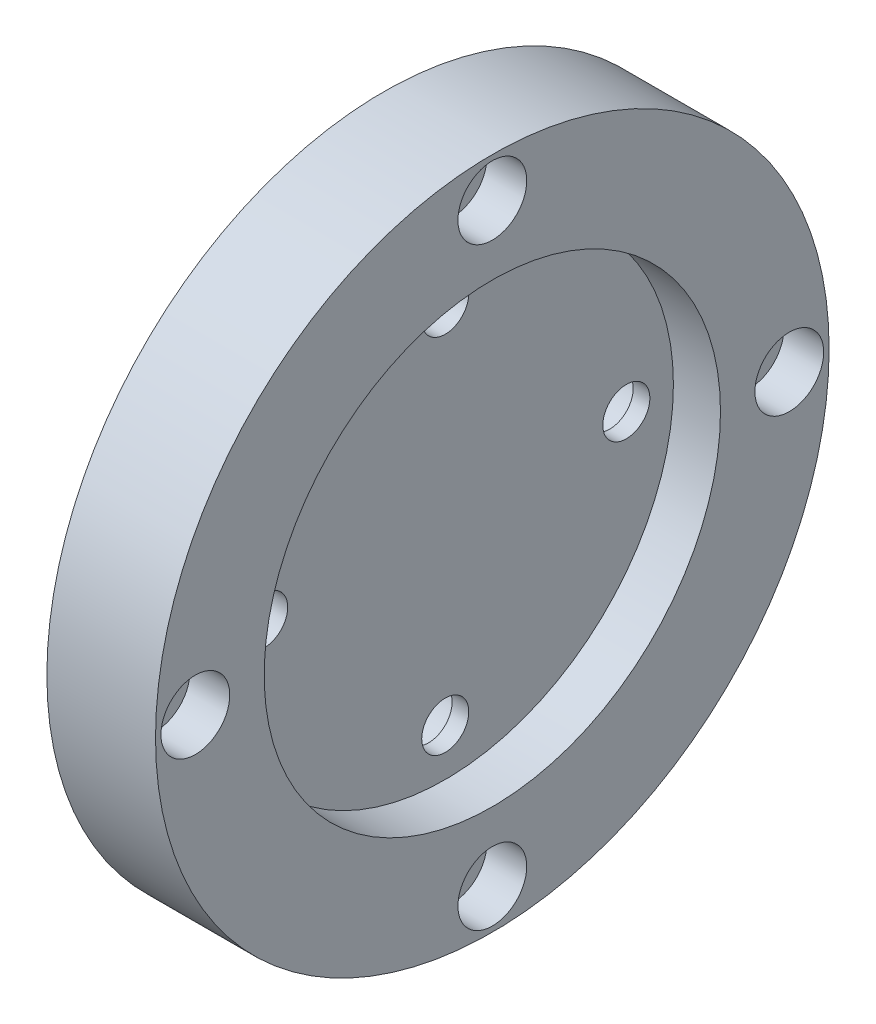
ISO-10303-21;
HEADER;
FILE_DESCRIPTION(('STEP AP214'),'2;1');
FILE_NAME('part.step','',(''),(''),'','','');
FILE_SCHEMA(('AUTOMOTIVE_DESIGN { 1 0 10303 214 1 1 1 1 }'));
ENDSEC;
DATA;
#1=APPLICATION_CONTEXT('core data for automotive mechanical design processes');
#2=APPLICATION_PROTOCOL_DEFINITION('international standard','automotive_design',2000,#1);
#3=PRODUCT_CONTEXT('',#1,'mechanical');
#4=PRODUCT('Part','Part','',(#3));
#5=PRODUCT_RELATED_PRODUCT_CATEGORY('part','',(#4));
#6=PRODUCT_DEFINITION_FORMATION('','',#4);
#7=PRODUCT_DEFINITION_CONTEXT('part definition',#1,'design');
#8=PRODUCT_DEFINITION('design','',#6,#7);
#9=PRODUCT_DEFINITION_SHAPE('','',#8);
#10=(LENGTH_UNIT() NAMED_UNIT(*) SI_UNIT(.MILLI.,.METRE.));
#11=(NAMED_UNIT(*) PLANE_ANGLE_UNIT() SI_UNIT($,.RADIAN.));
#12=(NAMED_UNIT(*) SI_UNIT($,.STERADIAN.) SOLID_ANGLE_UNIT());
#13=UNCERTAINTY_MEASURE_WITH_UNIT(LENGTH_MEASURE(1.E-05),#10,'distance_accuracy_value','');
#14=(GEOMETRIC_REPRESENTATION_CONTEXT(3) GLOBAL_UNCERTAINTY_ASSIGNED_CONTEXT((#13)) GLOBAL_UNIT_ASSIGNED_CONTEXT((#10,
#11,#12)) REPRESENTATION_CONTEXT('',''));
#15=CARTESIAN_POINT('',(0.,0.,0.));
#16=DIRECTION('',(0.,0.,1.));
#17=DIRECTION('',(1.,0.,0.));
#18=AXIS2_PLACEMENT_3D('',#15,#16,#17);
#19=CARTESIAN_POINT('',(0.,0.,-41.));
#20=DIRECTION('',(1.,0.,0.));
#21=DIRECTION('',(0.,0.,-1.));
#22=AXIS2_PLACEMENT_3D('',#19,#20,#21);
#23=CYLINDRICAL_SURFACE('',#22,2.75);
#24=CARTESIAN_POINT('',(0.,0.,-41.));
#25=DIRECTION('',(1.,0.,0.));
#26=DIRECTION('',(0.,0.,-1.));
#27=AXIS2_PLACEMENT_3D('',#24,#25,#26);
#28=CIRCLE('',#27,2.75);
#29=CARTESIAN_POINT('',(0.,0.,-43.75));
#30=VERTEX_POINT('',#29);
#31=EDGE_CURVE('E119',#30,#30,#28,.T.);
#32=ORIENTED_EDGE('',*,*,#31,.F.);
#33=EDGE_LOOP('',(#32));
#34=FACE_BOUND('',#33,.T.);
#35=CARTESIAN_POINT('',(9.5,0.,-41.));
#36=DIRECTION('',(1.,0.,0.));
#37=DIRECTION('',(0.,0.,-1.));
#38=AXIS2_PLACEMENT_3D('',#35,#36,#37);
#39=CIRCLE('',#38,2.75);
#40=CARTESIAN_POINT('',(9.5,0.,-43.75));
#41=VERTEX_POINT('',#40);
#42=EDGE_CURVE('E46',#41,#41,#39,.F.);
#43=ORIENTED_EDGE('',*,*,#42,.F.);
#44=EDGE_LOOP('',(#43));
#45=FACE_BOUND('',#44,.T.);
#46=ADVANCED_FACE('F42',(#34,#45),#23,.F.);
#47=CARTESIAN_POINT('',(0.,0.,41.));
#48=DIRECTION('',(1.,0.,0.));
#49=DIRECTION('',(0.,0.,-1.));
#50=AXIS2_PLACEMENT_3D('',#47,#48,#49);
#51=CYLINDRICAL_SURFACE('',#50,2.75);
#52=CARTESIAN_POINT('',(0.,0.,41.));
#53=DIRECTION('',(1.,0.,0.));
#54=DIRECTION('',(0.,0.,1.));
#55=AXIS2_PLACEMENT_3D('',#52,#53,#54);
#56=CIRCLE('',#55,2.75);
#57=CARTESIAN_POINT('',(0.,0.,43.75));
#58=VERTEX_POINT('',#57);
#59=EDGE_CURVE('E120',#58,#58,#56,.T.);
#60=ORIENTED_EDGE('',*,*,#59,.F.);
#61=EDGE_LOOP('',(#60));
#62=FACE_BOUND('',#61,.T.);
#63=CARTESIAN_POINT('',(9.5,0.,41.));
#64=DIRECTION('',(1.,0.,0.));
#65=DIRECTION('',(0.,0.,-1.));
#66=AXIS2_PLACEMENT_3D('',#63,#64,#65);
#67=CIRCLE('',#66,2.75);
#68=CARTESIAN_POINT('',(9.5,0.,38.25));
#69=VERTEX_POINT('',#68);
#70=EDGE_CURVE('E91',#69,#69,#67,.F.);
#71=ORIENTED_EDGE('',*,*,#70,.F.);
#72=EDGE_LOOP('',(#71));
#73=FACE_BOUND('',#72,.T.);
#74=ADVANCED_FACE('F203',(#62,#73),#51,.F.);
#75=CARTESIAN_POINT('',(0.,41.,1.43150734892568E-13));
#76=DIRECTION('',(1.,0.,0.));
#77=DIRECTION('',(0.,0.,-1.));
#78=AXIS2_PLACEMENT_3D('',#75,#76,#77);
#79=CYLINDRICAL_SURFACE('',#78,2.75);
#80=CARTESIAN_POINT('',(0.,41.,1.43150734892568E-13));
#81=DIRECTION('',(1.,0.,0.));
#82=DIRECTION('',(0.,1.,0.));
#83=AXIS2_PLACEMENT_3D('',#80,#81,#82);
#84=CIRCLE('',#83,2.75);
#85=CARTESIAN_POINT('',(0.,43.75,1.52752308574387E-13));
#86=VERTEX_POINT('',#85);
#87=EDGE_CURVE('E115',#86,#86,#84,.T.);
#88=ORIENTED_EDGE('',*,*,#87,.F.);
#89=EDGE_LOOP('',(#88));
#90=FACE_BOUND('',#89,.T.);
#91=CARTESIAN_POINT('',(9.5,41.,1.43150734892568E-13));
#92=DIRECTION('',(1.,0.,0.));
#93=DIRECTION('',(0.,0.,-1.));
#94=AXIS2_PLACEMENT_3D('',#91,#92,#93);
#95=CIRCLE('',#94,2.75);
#96=CARTESIAN_POINT('',(9.5,41.,-2.74999999999986));
#97=VERTEX_POINT('',#96);
#98=EDGE_CURVE('E88',#97,#97,#95,.F.);
#99=ORIENTED_EDGE('',*,*,#98,.F.);
#100=EDGE_LOOP('',(#99));
#101=FACE_BOUND('',#100,.T.);
#102=ADVANCED_FACE('F209',(#90,#101),#79,.F.);
#103=CARTESIAN_POINT('',(0.,-41.,-4.29452204677705E-13));
#104=DIRECTION('',(1.,0.,0.));
#105=DIRECTION('',(0.,0.,-1.));
#106=AXIS2_PLACEMENT_3D('',#103,#104,#105);
#107=CYLINDRICAL_SURFACE('',#106,2.75);
#108=CARTESIAN_POINT('',(0.,-41.,-4.29452204677705E-13));
#109=DIRECTION('',(1.,0.,0.));
#110=DIRECTION('',(0.,-1.,0.));
#111=AXIS2_PLACEMENT_3D('',#108,#109,#110);
#112=CIRCLE('',#111,2.75);
#113=CARTESIAN_POINT('',(0.,-43.75,-4.58256925723161E-13));
#114=VERTEX_POINT('',#113);
#115=EDGE_CURVE('E86',#114,#114,#112,.T.);
#116=ORIENTED_EDGE('',*,*,#115,.F.);
#117=EDGE_LOOP('',(#116));
#118=FACE_BOUND('',#117,.T.);
#119=CARTESIAN_POINT('',(9.5,-41.,-4.29452204677705E-13));
#120=DIRECTION('',(1.,0.,0.));
#121=DIRECTION('',(0.,0.,-1.));
#122=AXIS2_PLACEMENT_3D('',#119,#120,#121);
#123=CIRCLE('',#122,2.75);
#124=CARTESIAN_POINT('',(9.5,-41.,-2.75000000000043));
#125=VERTEX_POINT('',#124);
#126=EDGE_CURVE('E82',#125,#125,#123,.F.);
#127=ORIENTED_EDGE('',*,*,#126,.F.);
#128=EDGE_LOOP('',(#127));
#129=FACE_BOUND('',#128,.T.);
#130=ADVANCED_FACE('F216',(#118,#129),#107,.F.);
#131=CARTESIAN_POINT('',(0.,25.,0.));
#132=DIRECTION('',(1.,0.,0.));
#133=DIRECTION('',(0.,0.,-1.));
#134=AXIS2_PLACEMENT_3D('',#131,#132,#133);
#135=CYLINDRICAL_SURFACE('',#134,3.25);
#136=CARTESIAN_POINT('',(8.5,25.,0.));
#137=DIRECTION('',(1.,0.,0.));
#138=DIRECTION('',(0.,0.,-1.));
#139=AXIS2_PLACEMENT_3D('',#136,#137,#138);
#140=CIRCLE('',#139,3.25);
#141=CARTESIAN_POINT('',(8.5,25.,-3.25));
#142=VERTEX_POINT('',#141);
#143=EDGE_CURVE('E165',#142,#142,#140,.T.);
#144=ORIENTED_EDGE('',*,*,#143,.T.);
#145=EDGE_LOOP('',(#144));
#146=FACE_BOUND('',#145,.T.);
#147=CARTESIAN_POINT('',(6.2,25.,0.));
#148=DIRECTION('',(-1.,0.,0.));
#149=DIRECTION('',(0.,0.,1.));
#150=AXIS2_PLACEMENT_3D('',#147,#148,#149);
#151=CIRCLE('',#150,3.25);
#152=CARTESIAN_POINT('',(6.2,25.,3.25));
#153=VERTEX_POINT('',#152);
#154=EDGE_CURVE('E77',#153,#153,#151,.F.);
#155=ORIENTED_EDGE('',*,*,#154,.F.);
#156=EDGE_LOOP('',(#155));
#157=FACE_BOUND('',#156,.T.);
#158=ADVANCED_FACE('F261',(#146,#157),#135,.F.);
#159=CARTESIAN_POINT('',(0.,2.61861100413235E-13,25.));
#160=DIRECTION('',(1.,0.,0.));
#161=DIRECTION('',(0.,0.,-1.));
#162=AXIS2_PLACEMENT_3D('',#159,#160,#161);
#163=CYLINDRICAL_SURFACE('',#162,3.25);
#164=CARTESIAN_POINT('',(8.5,2.61861100413235E-13,25.));
#165=DIRECTION('',(1.,0.,0.));
#166=DIRECTION('',(0.,1.,0.));
#167=AXIS2_PLACEMENT_3D('',#164,#165,#166);
#168=CIRCLE('',#167,3.25);
#169=CARTESIAN_POINT('',(8.5,3.25000000000026,25.));
#170=VERTEX_POINT('',#169);
#171=EDGE_CURVE('E81',#170,#170,#168,.T.);
#172=ORIENTED_EDGE('',*,*,#171,.T.);
#173=EDGE_LOOP('',(#172));
#174=FACE_BOUND('',#173,.T.);
#175=CARTESIAN_POINT('',(6.2,2.61861100413235E-13,25.));
#176=DIRECTION('',(-1.,0.,0.));
#177=DIRECTION('',(0.,0.,1.));
#178=AXIS2_PLACEMENT_3D('',#175,#176,#177);
#179=CIRCLE('',#178,3.25);
#180=CARTESIAN_POINT('',(6.2,2.61861100413235E-13,28.25));
#181=VERTEX_POINT('',#180);
#182=EDGE_CURVE('E73',#181,#181,#179,.F.);
#183=ORIENTED_EDGE('',*,*,#182,.F.);
#184=EDGE_LOOP('',(#183));
#185=FACE_BOUND('',#184,.T.);
#186=ADVANCED_FACE('F257',(#174,#185),#163,.F.);
#187=CARTESIAN_POINT('',(0.,-25.,0.));
#188=DIRECTION('',(1.,0.,0.));
#189=DIRECTION('',(0.,0.,-1.));
#190=AXIS2_PLACEMENT_3D('',#187,#188,#189);
#191=CYLINDRICAL_SURFACE('',#190,3.25);
#192=CARTESIAN_POINT('',(8.5,-25.,0.));
#193=DIRECTION('',(1.,0.,0.));
#194=DIRECTION('',(0.,0.,1.));
#195=AXIS2_PLACEMENT_3D('',#192,#193,#194);
#196=CIRCLE('',#195,3.25);
#197=CARTESIAN_POINT('',(8.5,-25.,3.25));
#198=VERTEX_POINT('',#197);
#199=EDGE_CURVE('E166',#198,#198,#196,.T.);
#200=ORIENTED_EDGE('',*,*,#199,.T.);
#201=EDGE_LOOP('',(#200));
#202=FACE_BOUND('',#201,.T.);
#203=CARTESIAN_POINT('',(6.2,-25.,0.));
#204=DIRECTION('',(-1.,0.,0.));
#205=DIRECTION('',(0.,0.,1.));
#206=AXIS2_PLACEMENT_3D('',#203,#204,#205);
#207=CIRCLE('',#206,3.25);
#208=CARTESIAN_POINT('',(6.2,-25.,3.25));
#209=VERTEX_POINT('',#208);
#210=EDGE_CURVE('E68',#209,#209,#207,.F.);
#211=ORIENTED_EDGE('',*,*,#210,.F.);
#212=EDGE_LOOP('',(#211));
#213=FACE_BOUND('',#212,.T.);
#214=ADVANCED_FACE('F253',(#202,#213),#191,.F.);
#215=CARTESIAN_POINT('',(0.,0.,-25.));
#216=DIRECTION('',(1.,0.,0.));
#217=DIRECTION('',(0.,0.,-1.));
#218=AXIS2_PLACEMENT_3D('',#215,#216,#217);
#219=CYLINDRICAL_SURFACE('',#218,3.25);
#220=CARTESIAN_POINT('',(8.5,0.,-25.));
#221=DIRECTION('',(1.,0.,0.));
#222=DIRECTION('',(0.,-1.,0.));
#223=AXIS2_PLACEMENT_3D('',#220,#221,#222);
#224=CIRCLE('',#223,3.25);
#225=CARTESIAN_POINT('',(8.5,-3.25000000000009,-25.));
#226=VERTEX_POINT('',#225);
#227=EDGE_CURVE('E161',#226,#226,#224,.T.);
#228=ORIENTED_EDGE('',*,*,#227,.T.);
#229=EDGE_LOOP('',(#228));
#230=FACE_BOUND('',#229,.T.);
#231=CARTESIAN_POINT('',(6.2,0.,-25.));
#232=DIRECTION('',(-1.,0.,0.));
#233=DIRECTION('',(0.,0.,1.));
#234=AXIS2_PLACEMENT_3D('',#231,#232,#233);
#235=CIRCLE('',#234,3.25);
#236=CARTESIAN_POINT('',(6.2,0.,-21.75));
#237=VERTEX_POINT('',#236);
#238=EDGE_CURVE('E64',#237,#237,#235,.F.);
#239=ORIENTED_EDGE('',*,*,#238,.F.);
#240=EDGE_LOOP('',(#239));
#241=FACE_BOUND('',#240,.T.);
#242=ADVANCED_FACE('F197',(#230,#241),#219,.F.);
#243=CARTESIAN_POINT('',(15.,0.,0.));
#244=DIRECTION('',(-1.,0.,0.));
#245=DIRECTION('',(0.,0.,1.));
#246=AXIS2_PLACEMENT_3D('',#243,#244,#245);
#247=CYLINDRICAL_SURFACE('',#246,46.5);
#248=CARTESIAN_POINT('',(15.,0.,0.));
#249=DIRECTION('',(1.,0.,0.));
#250=DIRECTION('',(0.,0.,-1.));
#251=AXIS2_PLACEMENT_3D('',#248,#249,#250);
#252=CIRCLE('',#251,46.5);
#253=CARTESIAN_POINT('',(15.,0.,-46.5));
#254=VERTEX_POINT('',#253);
#255=EDGE_CURVE('E10',#254,#254,#252,.T.);
#256=ORIENTED_EDGE('',*,*,#255,.F.);
#257=EDGE_LOOP('',(#256));
#258=FACE_BOUND('',#257,.T.);
#259=CARTESIAN_POINT('',(0.,0.,0.));
#260=DIRECTION('',(1.,0.,0.));
#261=DIRECTION('',(0.,0.,-1.));
#262=AXIS2_PLACEMENT_3D('',#259,#260,#261);
#263=CIRCLE('',#262,46.5);
#264=CARTESIAN_POINT('',(0.,0.,-46.5));
#265=VERTEX_POINT('',#264);
#266=EDGE_CURVE('E51',#265,#265,#263,.T.);
#267=ORIENTED_EDGE('',*,*,#266,.T.);
#268=EDGE_LOOP('',(#267));
#269=FACE_BOUND('',#268,.T.);
#270=ADVANCED_FACE('F44',(#258,#269),#247,.T.);
#271=CARTESIAN_POINT('',(15.,0.,0.));
#272=DIRECTION('',(1.,0.,0.));
#273=DIRECTION('',(0.,0.,-1.));
#274=AXIS2_PLACEMENT_3D('',#271,#272,#273);
#275=PLANE('',#274);
#276=CARTESIAN_POINT('',(15.,5.73362156934817E-13,-41.));
#277=DIRECTION('',(1.,0.,0.));
#278=DIRECTION('',(0.,1.,0.));
#279=AXIS2_PLACEMENT_3D('',#276,#277,#278);
#280=CIRCLE('',#279,4.75);
#281=CARTESIAN_POINT('',(15.,4.75000000000057,-41.));
#282=VERTEX_POINT('',#281);
#283=EDGE_CURVE('E566',#282,#282,#280,.T.);
#284=ORIENTED_EDGE('',*,*,#283,.F.);
#285=EDGE_LOOP('',(#284));
#286=FACE_BOUND('',#285,.T.);
#287=CARTESIAN_POINT('',(15.,41.,4.30211422042248E-13));
#288=DIRECTION('',(1.,0.,0.));
#289=DIRECTION('',(0.,0.,1.));
#290=AXIS2_PLACEMENT_3D('',#287,#288,#289);
#291=CIRCLE('',#290,4.75);
#292=CARTESIAN_POINT('',(15.,41.,4.75000000000043));
#293=VERTEX_POINT('',#292);
#294=EDGE_CURVE('E575',#293,#293,#291,.T.);
#295=ORIENTED_EDGE('',*,*,#294,.F.);
#296=EDGE_LOOP('',(#295));
#297=FACE_BOUND('',#296,.T.);
#298=CARTESIAN_POINT('',(15.,-8.59663626719954E-13,41.));
#299=DIRECTION('',(1.,0.,0.));
#300=DIRECTION('',(0.,-1.,0.));
#301=AXIS2_PLACEMENT_3D('',#298,#299,#300);
#302=CIRCLE('',#301,4.75);
#303=CARTESIAN_POINT('',(15.,-4.75000000000086,41.));
#304=VERTEX_POINT('',#303);
#305=EDGE_CURVE('E584',#304,#304,#302,.T.);
#306=ORIENTED_EDGE('',*,*,#305,.F.);
#307=EDGE_LOOP('',(#306));
#308=FACE_BOUND('',#307,.T.);
#309=CARTESIAN_POINT('',(15.,-41.,-4.30211422042248E-13));
#310=DIRECTION('',(1.,0.,0.));
#311=DIRECTION('',(0.,0.,-1.));
#312=AXIS2_PLACEMENT_3D('',#309,#310,#311);
#313=CIRCLE('',#312,4.75);
#314=CARTESIAN_POINT('',(15.,-41.,-4.75000000000043));
#315=VERTEX_POINT('',#314);
#316=EDGE_CURVE('E100',#315,#315,#313,.T.);
#317=ORIENTED_EDGE('',*,*,#316,.F.);
#318=EDGE_LOOP('',(#317));
#319=FACE_BOUND('',#318,.T.);
#320=CARTESIAN_POINT('',(15.,0.,0.));
#321=DIRECTION('',(1.,0.,0.));
#322=DIRECTION('',(0.,0.,-1.));
#323=AXIS2_PLACEMENT_3D('',#320,#321,#322);
#324=CIRCLE('',#323,31.5);
#325=CARTESIAN_POINT('',(15.,0.,-31.5));
#326=VERTEX_POINT('',#325);
#327=EDGE_CURVE('E61',#326,#326,#324,.T.);
#328=ORIENTED_EDGE('',*,*,#327,.F.);
#329=EDGE_LOOP('',(#328));
#330=FACE_BOUND('',#329,.T.);
#331=ORIENTED_EDGE('',*,*,#255,.T.);
#332=EDGE_LOOP('',(#331));
#333=FACE_BOUND('',#332,.T.);
#334=ADVANCED_FACE('F187',(#286,#297,#308,#319,#330,#333),#275,.T.);
#335=CARTESIAN_POINT('',(0.,0.,0.));
#336=DIRECTION('',(1.,0.,0.));
#337=DIRECTION('',(0.,0.,-1.));
#338=AXIS2_PLACEMENT_3D('',#335,#336,#337);
#339=PLANE('',#338);
#340=ORIENTED_EDGE('',*,*,#87,.T.);
#341=EDGE_LOOP('',(#340));
#342=FACE_BOUND('',#341,.T.);
#343=ORIENTED_EDGE('',*,*,#59,.T.);
#344=EDGE_LOOP('',(#343));
#345=FACE_BOUND('',#344,.T.);
#346=ORIENTED_EDGE('',*,*,#115,.T.);
#347=EDGE_LOOP('',(#346));
#348=FACE_BOUND('',#347,.T.);
#349=ORIENTED_EDGE('',*,*,#31,.T.);
#350=EDGE_LOOP('',(#349));
#351=FACE_BOUND('',#350,.T.);
#352=CARTESIAN_POINT('',(0.,25.,0.));
#353=DIRECTION('',(-1.,0.,0.));
#354=DIRECTION('',(0.,0.,1.));
#355=AXIS2_PLACEMENT_3D('',#352,#353,#354);
#356=CIRCLE('',#355,5.5);
#357=CARTESIAN_POINT('',(0.,25.,5.5));
#358=VERTEX_POINT('',#357);
#359=EDGE_CURVE('E134',#358,#358,#356,.T.);
#360=ORIENTED_EDGE('',*,*,#359,.F.);
#361=EDGE_LOOP('',(#360));
#362=FACE_BOUND('',#361,.T.);
#363=CARTESIAN_POINT('',(0.,0.,-25.));
#364=DIRECTION('',(-1.,0.,0.));
#365=DIRECTION('',(0.,0.,1.));
#366=AXIS2_PLACEMENT_3D('',#363,#364,#365);
#367=CIRCLE('',#366,5.5);
#368=CARTESIAN_POINT('',(0.,0.,-19.5));
#369=VERTEX_POINT('',#368);
#370=EDGE_CURVE('E138',#369,#369,#367,.T.);
#371=ORIENTED_EDGE('',*,*,#370,.F.);
#372=EDGE_LOOP('',(#371));
#373=FACE_BOUND('',#372,.T.);
#374=CARTESIAN_POINT('',(0.,-25.,0.));
#375=DIRECTION('',(-1.,0.,0.));
#376=DIRECTION('',(0.,0.,1.));
#377=AXIS2_PLACEMENT_3D('',#374,#375,#376);
#378=CIRCLE('',#377,5.5);
#379=CARTESIAN_POINT('',(0.,-25.,5.5));
#380=VERTEX_POINT('',#379);
#381=EDGE_CURVE('E146',#380,#380,#378,.T.);
#382=ORIENTED_EDGE('',*,*,#381,.F.);
#383=EDGE_LOOP('',(#382));
#384=FACE_BOUND('',#383,.T.);
#385=CARTESIAN_POINT('',(0.,2.61861100413235E-13,25.));
#386=DIRECTION('',(-1.,0.,0.));
#387=DIRECTION('',(0.,0.,1.));
#388=AXIS2_PLACEMENT_3D('',#385,#386,#387);
#389=CIRCLE('',#388,5.5);
#390=CARTESIAN_POINT('',(0.,2.61861100413235E-13,30.5));
#391=VERTEX_POINT('',#390);
#392=EDGE_CURVE('E154',#391,#391,#389,.T.);
#393=ORIENTED_EDGE('',*,*,#392,.F.);
#394=EDGE_LOOP('',(#393));
#395=FACE_BOUND('',#394,.T.);
#396=ORIENTED_EDGE('',*,*,#266,.F.);
#397=EDGE_LOOP('',(#396));
#398=FACE_BOUND('',#397,.T.);
#399=ADVANCED_FACE('F189',(#342,#345,#348,#351,#362,#373,#384,#395,#398),#339,.F.);
#400=CARTESIAN_POINT('',(8.5,0.,0.));
#401=DIRECTION('',(1.,0.,0.));
#402=DIRECTION('',(0.,0.,-1.));
#403=AXIS2_PLACEMENT_3D('',#400,#401,#402);
#404=CYLINDRICAL_SURFACE('',#403,31.5);
#405=CARTESIAN_POINT('',(8.5,0.,0.));
#406=DIRECTION('',(1.,0.,0.));
#407=DIRECTION('',(0.,0.,-1.));
#408=AXIS2_PLACEMENT_3D('',#405,#406,#407);
#409=CIRCLE('',#408,31.5);
#410=CARTESIAN_POINT('',(8.5,0.,-31.5));
#411=VERTEX_POINT('',#410);
#412=EDGE_CURVE('E58',#411,#411,#409,.T.);
#413=ORIENTED_EDGE('',*,*,#412,.F.);
#414=EDGE_LOOP('',(#413));
#415=FACE_BOUND('',#414,.T.);
#416=ORIENTED_EDGE('',*,*,#327,.T.);
#417=EDGE_LOOP('',(#416));
#418=FACE_BOUND('',#417,.T.);
#419=ADVANCED_FACE('F185',(#415,#418),#404,.F.);
#420=CARTESIAN_POINT('',(8.5,0.,0.));
#421=DIRECTION('',(1.,0.,0.));
#422=DIRECTION('',(0.,0.,-1.));
#423=AXIS2_PLACEMENT_3D('',#420,#421,#422);
#424=PLANE('',#423);
#425=ORIENTED_EDGE('',*,*,#227,.F.);
#426=EDGE_LOOP('',(#425));
#427=FACE_BOUND('',#426,.T.);
#428=ORIENTED_EDGE('',*,*,#199,.F.);
#429=EDGE_LOOP('',(#428));
#430=FACE_BOUND('',#429,.T.);
#431=ORIENTED_EDGE('',*,*,#171,.F.);
#432=EDGE_LOOP('',(#431));
#433=FACE_BOUND('',#432,.T.);
#434=ORIENTED_EDGE('',*,*,#143,.F.);
#435=EDGE_LOOP('',(#434));
#436=FACE_BOUND('',#435,.T.);
#437=ORIENTED_EDGE('',*,*,#412,.T.);
#438=EDGE_LOOP('',(#437));
#439=FACE_BOUND('',#438,.T.);
#440=ADVANCED_FACE('F235',(#427,#430,#433,#436,#439),#424,.T.);
#441=CARTESIAN_POINT('',(6.2,0.,-25.));
#442=DIRECTION('',(-1.,0.,0.));
#443=DIRECTION('',(0.,0.,1.));
#444=AXIS2_PLACEMENT_3D('',#441,#442,#443);
#445=PLANE('',#444);
#446=CARTESIAN_POINT('',(6.2,0.,-25.));
#447=DIRECTION('',(-1.,0.,0.));
#448=DIRECTION('',(0.,0.,1.));
#449=AXIS2_PLACEMENT_3D('',#446,#447,#448);
#450=CIRCLE('',#449,5.5);
#451=CARTESIAN_POINT('',(6.2,0.,-19.5));
#452=VERTEX_POINT('',#451);
#453=EDGE_CURVE('E142',#452,#452,#450,.T.);
#454=ORIENTED_EDGE('',*,*,#453,.T.);
#455=EDGE_LOOP('',(#454));
#456=FACE_BOUND('',#455,.T.);
#457=ORIENTED_EDGE('',*,*,#238,.T.);
#458=EDGE_LOOP('',(#457));
#459=FACE_BOUND('',#458,.T.);
#460=ADVANCED_FACE('F231',(#456,#459),#445,.T.);
#461=CARTESIAN_POINT('',(6.2,0.,-25.));
#462=DIRECTION('',(-1.,0.,0.));
#463=DIRECTION('',(0.,0.,1.));
#464=AXIS2_PLACEMENT_3D('',#461,#462,#463);
#465=CYLINDRICAL_SURFACE('',#464,5.5);
#466=ORIENTED_EDGE('',*,*,#453,.F.);
#467=EDGE_LOOP('',(#466));
#468=FACE_BOUND('',#467,.T.);
#469=ORIENTED_EDGE('',*,*,#370,.T.);
#470=EDGE_LOOP('',(#469));
#471=FACE_BOUND('',#470,.T.);
#472=ADVANCED_FACE('F227',(#468,#471),#465,.F.);
#473=CARTESIAN_POINT('',(6.2,-25.,0.));
#474=DIRECTION('',(-1.,0.,0.));
#475=DIRECTION('',(0.,0.,1.));
#476=AXIS2_PLACEMENT_3D('',#473,#474,#475);
#477=PLANE('',#476);
#478=CARTESIAN_POINT('',(6.2,-25.,0.));
#479=DIRECTION('',(-1.,0.,0.));
#480=DIRECTION('',(0.,0.,1.));
#481=AXIS2_PLACEMENT_3D('',#478,#479,#480);
#482=CIRCLE('',#481,5.5);
#483=CARTESIAN_POINT('',(6.2,-25.,5.5));
#484=VERTEX_POINT('',#483);
#485=EDGE_CURVE('E150',#484,#484,#482,.T.);
#486=ORIENTED_EDGE('',*,*,#485,.T.);
#487=EDGE_LOOP('',(#486));
#488=FACE_BOUND('',#487,.T.);
#489=ORIENTED_EDGE('',*,*,#210,.T.);
#490=EDGE_LOOP('',(#489));
#491=FACE_BOUND('',#490,.T.);
#492=ADVANCED_FACE('F230',(#488,#491),#477,.T.);
#493=CARTESIAN_POINT('',(6.2,-25.,0.));
#494=DIRECTION('',(-1.,0.,0.));
#495=DIRECTION('',(0.,0.,1.));
#496=AXIS2_PLACEMENT_3D('',#493,#494,#495);
#497=CYLINDRICAL_SURFACE('',#496,5.5);
#498=ORIENTED_EDGE('',*,*,#485,.F.);
#499=EDGE_LOOP('',(#498));
#500=FACE_BOUND('',#499,.T.);
#501=ORIENTED_EDGE('',*,*,#381,.T.);
#502=EDGE_LOOP('',(#501));
#503=FACE_BOUND('',#502,.T.);
#504=ADVANCED_FACE('F237',(#500,#503),#497,.F.);
#505=CARTESIAN_POINT('',(6.2,2.61861100413235E-13,25.));
#506=DIRECTION('',(-1.,0.,0.));
#507=DIRECTION('',(0.,0.,1.));
#508=AXIS2_PLACEMENT_3D('',#505,#506,#507);
#509=PLANE('',#508);
#510=CARTESIAN_POINT('',(6.2,2.61861100413235E-13,25.));
#511=DIRECTION('',(-1.,0.,0.));
#512=DIRECTION('',(0.,0.,1.));
#513=AXIS2_PLACEMENT_3D('',#510,#511,#512);
#514=CIRCLE('',#513,5.5);
#515=CARTESIAN_POINT('',(6.2,2.61861100413235E-13,30.5));
#516=VERTEX_POINT('',#515);
#517=EDGE_CURVE('E130',#516,#516,#514,.T.);
#518=ORIENTED_EDGE('',*,*,#517,.T.);
#519=EDGE_LOOP('',(#518));
#520=FACE_BOUND('',#519,.T.);
#521=ORIENTED_EDGE('',*,*,#182,.T.);
#522=EDGE_LOOP('',(#521));
#523=FACE_BOUND('',#522,.T.);
#524=ADVANCED_FACE('F240',(#520,#523),#509,.T.);
#525=CARTESIAN_POINT('',(6.2,2.61861100413235E-13,25.));
#526=DIRECTION('',(-1.,0.,0.));
#527=DIRECTION('',(0.,0.,1.));
#528=AXIS2_PLACEMENT_3D('',#525,#526,#527);
#529=CYLINDRICAL_SURFACE('',#528,5.5);
#530=ORIENTED_EDGE('',*,*,#517,.F.);
#531=EDGE_LOOP('',(#530));
#532=FACE_BOUND('',#531,.T.);
#533=ORIENTED_EDGE('',*,*,#392,.T.);
#534=EDGE_LOOP('',(#533));
#535=FACE_BOUND('',#534,.T.);
#536=ADVANCED_FACE('F221',(#532,#535),#529,.F.);
#537=CARTESIAN_POINT('',(6.2,25.,0.));
#538=DIRECTION('',(-1.,0.,0.));
#539=DIRECTION('',(0.,0.,1.));
#540=AXIS2_PLACEMENT_3D('',#537,#538,#539);
#541=PLANE('',#540);
#542=CARTESIAN_POINT('',(6.2,25.,0.));
#543=DIRECTION('',(-1.,0.,0.));
#544=DIRECTION('',(0.,0.,1.));
#545=AXIS2_PLACEMENT_3D('',#542,#543,#544);
#546=CIRCLE('',#545,5.5);
#547=CARTESIAN_POINT('',(6.2,25.,5.5));
#548=VERTEX_POINT('',#547);
#549=EDGE_CURVE('E69',#548,#548,#546,.T.);
#550=ORIENTED_EDGE('',*,*,#549,.T.);
#551=EDGE_LOOP('',(#550));
#552=FACE_BOUND('',#551,.T.);
#553=ORIENTED_EDGE('',*,*,#154,.T.);
#554=EDGE_LOOP('',(#553));
#555=FACE_BOUND('',#554,.T.);
#556=ADVANCED_FACE('F217',(#552,#555),#541,.T.);
#557=CARTESIAN_POINT('',(6.2,25.,0.));
#558=DIRECTION('',(-1.,0.,0.));
#559=DIRECTION('',(0.,0.,1.));
#560=AXIS2_PLACEMENT_3D('',#557,#558,#559);
#561=CYLINDRICAL_SURFACE('',#560,5.5);
#562=ORIENTED_EDGE('',*,*,#549,.F.);
#563=EDGE_LOOP('',(#562));
#564=FACE_BOUND('',#563,.T.);
#565=ORIENTED_EDGE('',*,*,#359,.T.);
#566=EDGE_LOOP('',(#565));
#567=FACE_BOUND('',#566,.T.);
#568=ADVANCED_FACE('F220',(#564,#567),#561,.F.);
#569=CARTESIAN_POINT('',(9.5,-41.,-4.30211422042248E-13));
#570=DIRECTION('',(1.,0.,0.));
#571=DIRECTION('',(0.,0.,-1.));
#572=AXIS2_PLACEMENT_3D('',#569,#570,#571);
#573=PLANE('',#572);
#574=CARTESIAN_POINT('',(9.5,-41.,-4.30211422042248E-13));
#575=DIRECTION('',(1.,0.,0.));
#576=DIRECTION('',(0.,0.,-1.));
#577=AXIS2_PLACEMENT_3D('',#574,#575,#576);
#578=CIRCLE('',#577,4.75);
#579=CARTESIAN_POINT('',(9.5,-41.,-4.75000000000043));
#580=VERTEX_POINT('',#579);
#581=EDGE_CURVE('E87',#580,#580,#578,.T.);
#582=ORIENTED_EDGE('',*,*,#581,.T.);
#583=EDGE_LOOP('',(#582));
#584=FACE_BOUND('',#583,.T.);
#585=ORIENTED_EDGE('',*,*,#126,.T.);
#586=EDGE_LOOP('',(#585));
#587=FACE_BOUND('',#586,.T.);
#588=ADVANCED_FACE('F225',(#584,#587),#573,.T.);
#589=CARTESIAN_POINT('',(9.5,-41.,-4.30211422042248E-13));
#590=DIRECTION('',(1.,0.,0.));
#591=DIRECTION('',(0.,0.,-1.));
#592=AXIS2_PLACEMENT_3D('',#589,#590,#591);
#593=CYLINDRICAL_SURFACE('',#592,4.75);
#594=ORIENTED_EDGE('',*,*,#581,.F.);
#595=EDGE_LOOP('',(#594));
#596=FACE_BOUND('',#595,.T.);
#597=ORIENTED_EDGE('',*,*,#316,.T.);
#598=EDGE_LOOP('',(#597));
#599=FACE_BOUND('',#598,.T.);
#600=ADVANCED_FACE('F319',(#596,#599),#593,.F.);
#601=CARTESIAN_POINT('',(9.5,41.,4.30211422042248E-13));
#602=DIRECTION('',(1.,0.,0.));
#603=DIRECTION('',(0.,0.,1.));
#604=AXIS2_PLACEMENT_3D('',#601,#602,#603);
#605=PLANE('',#604);
#606=CARTESIAN_POINT('',(9.5,41.,4.30211422042248E-13));
#607=DIRECTION('',(1.,0.,0.));
#608=DIRECTION('',(0.,0.,1.));
#609=AXIS2_PLACEMENT_3D('',#606,#607,#608);
#610=CIRCLE('',#609,4.75);
#611=CARTESIAN_POINT('',(9.5,41.,4.75000000000043));
#612=VERTEX_POINT('',#611);
#613=EDGE_CURVE('E568',#612,#612,#610,.T.);
#614=ORIENTED_EDGE('',*,*,#613,.T.);
#615=EDGE_LOOP('',(#614));
#616=FACE_BOUND('',#615,.T.);
#617=ORIENTED_EDGE('',*,*,#98,.T.);
#618=EDGE_LOOP('',(#617));
#619=FACE_BOUND('',#618,.T.);
#620=ADVANCED_FACE('F328',(#616,#619),#605,.T.);
#621=CARTESIAN_POINT('',(9.5,41.,4.30211422042248E-13));
#622=DIRECTION('',(1.,0.,0.));
#623=DIRECTION('',(0.,0.,-1.));
#624=AXIS2_PLACEMENT_3D('',#621,#622,#623);
#625=CYLINDRICAL_SURFACE('',#624,4.75);
#626=ORIENTED_EDGE('',*,*,#613,.F.);
#627=EDGE_LOOP('',(#626));
#628=FACE_BOUND('',#627,.T.);
#629=ORIENTED_EDGE('',*,*,#294,.T.);
#630=EDGE_LOOP('',(#629));
#631=FACE_BOUND('',#630,.T.);
#632=ADVANCED_FACE('F336',(#628,#631),#625,.F.);
#633=CARTESIAN_POINT('',(9.5,-8.59663626719954E-13,41.));
#634=DIRECTION('',(1.,0.,0.));
#635=DIRECTION('',(0.,-1.,0.));
#636=AXIS2_PLACEMENT_3D('',#633,#634,#635);
#637=PLANE('',#636);
#638=CARTESIAN_POINT('',(9.5,-8.59663626719954E-13,41.));
#639=DIRECTION('',(1.,0.,0.));
#640=DIRECTION('',(0.,-1.,0.));
#641=AXIS2_PLACEMENT_3D('',#638,#639,#640);
#642=CIRCLE('',#641,4.75);
#643=CARTESIAN_POINT('',(9.5,-4.75000000000086,41.));
#644=VERTEX_POINT('',#643);
#645=EDGE_CURVE('E581',#644,#644,#642,.T.);
#646=ORIENTED_EDGE('',*,*,#645,.T.);
#647=EDGE_LOOP('',(#646));
#648=FACE_BOUND('',#647,.T.);
#649=ORIENTED_EDGE('',*,*,#70,.T.);
#650=EDGE_LOOP('',(#649));
#651=FACE_BOUND('',#650,.T.);
#652=ADVANCED_FACE('F344',(#648,#651),#637,.T.);
#653=CARTESIAN_POINT('',(9.5,-8.59663626719954E-13,41.));
#654=DIRECTION('',(1.,0.,0.));
#655=DIRECTION('',(0.,0.,-1.));
#656=AXIS2_PLACEMENT_3D('',#653,#654,#655);
#657=CYLINDRICAL_SURFACE('',#656,4.75);
#658=ORIENTED_EDGE('',*,*,#645,.F.);
#659=EDGE_LOOP('',(#658));
#660=FACE_BOUND('',#659,.T.);
#661=ORIENTED_EDGE('',*,*,#305,.T.);
#662=EDGE_LOOP('',(#661));
#663=FACE_BOUND('',#662,.T.);
#664=ADVANCED_FACE('F352',(#660,#663),#657,.F.);
#665=CARTESIAN_POINT('',(9.5,5.73362156934817E-13,-41.));
#666=DIRECTION('',(1.,0.,0.));
#667=DIRECTION('',(0.,1.,0.));
#668=AXIS2_PLACEMENT_3D('',#665,#666,#667);
#669=PLANE('',#668);
#670=CARTESIAN_POINT('',(9.5,5.73362156934817E-13,-41.));
#671=DIRECTION('',(1.,0.,0.));
#672=DIRECTION('',(0.,1.,0.));
#673=AXIS2_PLACEMENT_3D('',#670,#671,#672);
#674=CIRCLE('',#673,4.75);
#675=CARTESIAN_POINT('',(9.5,4.75000000000057,-41.));
#676=VERTEX_POINT('',#675);
#677=EDGE_CURVE('E92',#676,#676,#674,.T.);
#678=ORIENTED_EDGE('',*,*,#677,.T.);
#679=EDGE_LOOP('',(#678));
#680=FACE_BOUND('',#679,.T.);
#681=ORIENTED_EDGE('',*,*,#42,.T.);
#682=EDGE_LOOP('',(#681));
#683=FACE_BOUND('',#682,.T.);
#684=ADVANCED_FACE('F360',(#680,#683),#669,.T.);
#685=CARTESIAN_POINT('',(9.5,5.73362156934817E-13,-41.));
#686=DIRECTION('',(1.,0.,0.));
#687=DIRECTION('',(0.,0.,-1.));
#688=AXIS2_PLACEMENT_3D('',#685,#686,#687);
#689=CYLINDRICAL_SURFACE('',#688,4.75);
#690=ORIENTED_EDGE('',*,*,#677,.F.);
#691=EDGE_LOOP('',(#690));
#692=FACE_BOUND('',#691,.T.);
#693=ORIENTED_EDGE('',*,*,#283,.T.);
#694=EDGE_LOOP('',(#693));
#695=FACE_BOUND('',#694,.T.);
#696=ADVANCED_FACE('F368',(#692,#695),#689,.F.);
#697=CLOSED_SHELL('',(#46,#74,#102,#130,#158,#186,#214,#242,#270,#334,#399,#419,#440,#460,#472,
#492,#504,#524,#536,#556,#568,#588,#600,#620,#632,#652,#664,#684,#696));
#698=MANIFOLD_SOLID_BREP('B2',#697);
#699=ADVANCED_BREP_SHAPE_REPRESENTATION('',(#18,#698),#14);
#700=SHAPE_DEFINITION_REPRESENTATION(#9,#699);
ENDSEC;
END-ISO-10303-21;
